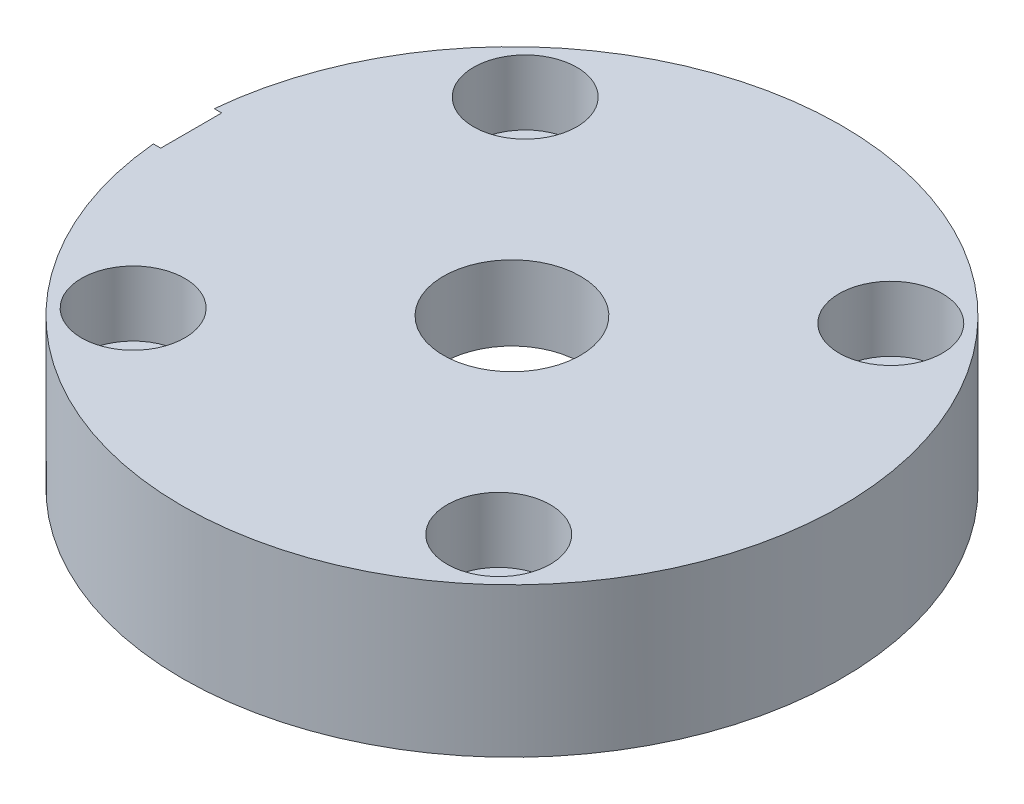
ISO-10303-21;
HEADER;
FILE_DESCRIPTION(('STEP AP214'),'2;1');
FILE_NAME('part.step','',(''),(''),'','','');
FILE_SCHEMA(('AUTOMOTIVE_DESIGN { 1 0 10303 214 1 1 1 1 }'));
ENDSEC;
DATA;
#1=APPLICATION_CONTEXT('core data for automotive mechanical design processes');
#2=APPLICATION_PROTOCOL_DEFINITION('international standard','automotive_design',2000,#1);
#3=PRODUCT_CONTEXT('',#1,'mechanical');
#4=PRODUCT('Part','Part','',(#3));
#5=PRODUCT_RELATED_PRODUCT_CATEGORY('part','',(#4));
#6=PRODUCT_DEFINITION_FORMATION('','',#4);
#7=PRODUCT_DEFINITION_CONTEXT('part definition',#1,'design');
#8=PRODUCT_DEFINITION('design','',#6,#7);
#9=PRODUCT_DEFINITION_SHAPE('','',#8);
#10=(LENGTH_UNIT() NAMED_UNIT(*) SI_UNIT(.MILLI.,.METRE.));
#11=(NAMED_UNIT(*) PLANE_ANGLE_UNIT() SI_UNIT($,.RADIAN.));
#12=(NAMED_UNIT(*) SI_UNIT($,.STERADIAN.) SOLID_ANGLE_UNIT());
#13=UNCERTAINTY_MEASURE_WITH_UNIT(LENGTH_MEASURE(1.E-05),#10,'distance_accuracy_value','');
#14=(GEOMETRIC_REPRESENTATION_CONTEXT(3) GLOBAL_UNCERTAINTY_ASSIGNED_CONTEXT((#13)) GLOBAL_UNIT_ASSIGNED_CONTEXT((#10,
#11,#12)) REPRESENTATION_CONTEXT('',''));
#15=CARTESIAN_POINT('',(0.,0.,0.));
#16=DIRECTION('',(0.,0.,1.));
#17=DIRECTION('',(1.,0.,0.));
#18=AXIS2_PLACEMENT_3D('',#15,#16,#17);
#19=CARTESIAN_POINT('',(19.05,0.,0.));
#20=DIRECTION('',(0.,1.,0.));
#21=DIRECTION('',(0.,0.,1.));
#22=AXIS2_PLACEMENT_3D('',#19,#20,#21);
#23=PLANE('',#22);
#24=CARTESIAN_POINT('',(-14.930490242014,0.,-4.1405913989565));
#25=DIRECTION('',(0.,-1.,0.));
#26=DIRECTION('',(0.,0.,-1.));
#27=AXIS2_PLACEMENT_3D('',#24,#25,#26);
#28=CIRCLE('',#27,1.72720000000001);
#29=CARTESIAN_POINT('',(-14.930490242014,0.,-5.86779139895651));
#30=VERTEX_POINT('',#29);
#31=EDGE_CURVE('E204',#30,#30,#28,.T.);
#32=ORIENTED_EDGE('',*,*,#31,.F.);
#33=EDGE_LOOP('',(#32));
#34=FACE_BOUND('',#33,.T.);
#35=CARTESIAN_POINT('',(4.1405913989565,0.,-14.930490242014));
#36=DIRECTION('',(0.,-1.,0.));
#37=DIRECTION('',(0.,0.,-1.));
#38=AXIS2_PLACEMENT_3D('',#35,#36,#37);
#39=CIRCLE('',#38,1.72720000000001);
#40=CARTESIAN_POINT('',(4.1405913989565,0.,-16.657690242014));
#41=VERTEX_POINT('',#40);
#42=EDGE_CURVE('E208',#41,#41,#39,.T.);
#43=ORIENTED_EDGE('',*,*,#42,.F.);
#44=EDGE_LOOP('',(#43));
#45=FACE_BOUND('',#44,.T.);
#46=CARTESIAN_POINT('',(14.930490242014,0.,4.1405913989565));
#47=DIRECTION('',(0.,-1.,0.));
#48=DIRECTION('',(0.,0.,-1.));
#49=AXIS2_PLACEMENT_3D('',#46,#47,#48);
#50=CIRCLE('',#49,1.72720000000002);
#51=CARTESIAN_POINT('',(14.930490242014,0.,2.41339139895649));
#52=VERTEX_POINT('',#51);
#53=EDGE_CURVE('E212',#52,#52,#50,.T.);
#54=ORIENTED_EDGE('',*,*,#53,.F.);
#55=EDGE_LOOP('',(#54));
#56=FACE_BOUND('',#55,.T.);
#57=CARTESIAN_POINT('',(-4.1405913989565,0.,14.930490242014));
#58=DIRECTION('',(0.,-1.,0.));
#59=DIRECTION('',(0.,0.,-1.));
#60=AXIS2_PLACEMENT_3D('',#57,#58,#59);
#61=CIRCLE('',#60,1.72720000000001);
#62=CARTESIAN_POINT('',(-4.1405913989565,0.,13.203290242014));
#63=VERTEX_POINT('',#62);
#64=EDGE_CURVE('E216',#63,#63,#61,.T.);
#65=ORIENTED_EDGE('',*,*,#64,.F.);
#66=EDGE_LOOP('',(#65));
#67=FACE_BOUND('',#66,.T.);
#68=CARTESIAN_POINT('',(0.,0.,0.));
#69=DIRECTION('',(0.,1.,0.));
#70=DIRECTION('',(0.,0.,1.));
#71=AXIS2_PLACEMENT_3D('',#68,#69,#70);
#72=CIRCLE('',#71,19.05);
#73=CARTESIAN_POINT('',(0.,0.,19.05));
#74=VERTEX_POINT('',#73);
#75=EDGE_CURVE('E172',#74,#74,#72,.T.);
#76=ORIENTED_EDGE('',*,*,#75,.F.);
#77=EDGE_LOOP('',(#76));
#78=FACE_BOUND('',#77,.T.);
#79=CARTESIAN_POINT('',(-10.566882590808,0.,-11.331594252887));
#80=DIRECTION('',(0.,1.,0.));
#81=DIRECTION('',(0.,0.,1.));
#82=AXIS2_PLACEMENT_3D('',#79,#80,#81);
#83=CIRCLE('',#82,1.98120000000001);
#84=CARTESIAN_POINT('',(-10.566882590808,0.,-9.35039425288699));
#85=VERTEX_POINT('',#84);
#86=EDGE_CURVE('E155',#85,#85,#83,.T.);
#87=ORIENTED_EDGE('',*,*,#86,.T.);
#88=EDGE_LOOP('',(#87));
#89=FACE_BOUND('',#88,.T.);
#90=CARTESIAN_POINT('',(-11.331594252887,0.,10.566882590808));
#91=DIRECTION('',(0.,1.,0.));
#92=DIRECTION('',(0.,0.,1.));
#93=AXIS2_PLACEMENT_3D('',#90,#91,#92);
#94=CIRCLE('',#93,1.98120000000001);
#95=CARTESIAN_POINT('',(-11.331594252887,0.,12.548082590808));
#96=VERTEX_POINT('',#95);
#97=EDGE_CURVE('E143',#96,#96,#94,.T.);
#98=ORIENTED_EDGE('',*,*,#97,.T.);
#99=EDGE_LOOP('',(#98));
#100=FACE_BOUND('',#99,.T.);
#101=CARTESIAN_POINT('',(10.566882590808,0.,11.331594252887));
#102=DIRECTION('',(0.,1.,0.));
#103=DIRECTION('',(0.,0.,1.));
#104=AXIS2_PLACEMENT_3D('',#101,#102,#103);
#105=CIRCLE('',#104,1.98120000000001);
#106=CARTESIAN_POINT('',(10.566882590808,0.,13.312794252887));
#107=VERTEX_POINT('',#106);
#108=EDGE_CURVE('E131',#107,#107,#105,.T.);
#109=ORIENTED_EDGE('',*,*,#108,.T.);
#110=EDGE_LOOP('',(#109));
#111=FACE_BOUND('',#110,.T.);
#112=CARTESIAN_POINT('',(11.331594252887,0.,-10.566882590808));
#113=DIRECTION('',(0.,1.,0.));
#114=DIRECTION('',(0.,0.,1.));
#115=AXIS2_PLACEMENT_3D('',#112,#113,#114);
#116=CIRCLE('',#115,1.98120000000001);
#117=CARTESIAN_POINT('',(11.331594252887,0.,-8.58568259080799));
#118=VERTEX_POINT('',#117);
#119=EDGE_CURVE('E119',#118,#118,#116,.T.);
#120=ORIENTED_EDGE('',*,*,#119,.T.);
#121=EDGE_LOOP('',(#120));
#122=FACE_BOUND('',#121,.T.);
#123=CARTESIAN_POINT('',(0.,0.,0.));
#124=DIRECTION('',(0.,1.,0.));
#125=DIRECTION('',(0.,0.,1.));
#126=AXIS2_PLACEMENT_3D('',#123,#124,#125);
#127=CIRCLE('',#126,10.3124);
#128=CARTESIAN_POINT('',(0.,0.,10.3124));
#129=VERTEX_POINT('',#128);
#130=EDGE_CURVE('E100',#129,#129,#127,.T.);
#131=ORIENTED_EDGE('',*,*,#130,.T.);
#132=EDGE_LOOP('',(#131));
#133=FACE_BOUND('',#132,.T.);
#134=ADVANCED_FACE('F38',(#34,#45,#56,#67,#78,#89,#100,#111,#122,#133),#23,.F.);
#135=CARTESIAN_POINT('',(-6.7286871769978,5.08,0.));
#136=DIRECTION('',(-1.,0.,0.));
#137=DIRECTION('',(0.,0.,1.));
#138=AXIS2_PLACEMENT_3D('',#135,#136,#137);
#139=CYLINDRICAL_SURFACE('',#138,1.98374);
#140=CARTESIAN_POINT('',(-18.11274,5.08,0.));
#141=DIRECTION('',(-1.,0.,0.));
#142=DIRECTION('',(0.,0.,1.));
#143=AXIS2_PLACEMENT_3D('',#140,#141,#142);
#144=CIRCLE('',#143,1.98374);
#145=CARTESIAN_POINT('',(-18.11274,5.08,1.98374));
#146=VERTEX_POINT('',#145);
#147=EDGE_CURVE('E159',#146,#146,#144,.T.);
#148=ORIENTED_EDGE('',*,*,#147,.T.);
#149=EDGE_LOOP('',(#148));
#150=FACE_BOUND('',#149,.T.);
#151=CARTESIAN_POINT('',(-7.874,5.08,0.));
#152=DIRECTION('',(-1.,0.,0.));
#153=DIRECTION('',(0.,0.,1.));
#154=AXIS2_PLACEMENT_3D('',#151,#152,#153);
#155=CIRCLE('',#154,1.98374);
#156=CARTESIAN_POINT('',(-7.874,4.318,1.831551360896));
#157=VERTEX_POINT('',#156);
#158=CARTESIAN_POINT('',(-7.874,4.318,-1.831551360896));
#159=VERTEX_POINT('',#158);
#160=EDGE_CURVE('E103',#157,#159,#155,.T.);
#161=ORIENTED_EDGE('',*,*,#160,.F.);
#162=DIRECTION('',(-1.,0.,0.));
#163=VECTOR('',#162,1.);
#164=CARTESIAN_POINT('',(-6.7286871769978,4.318,1.831551360896));
#165=LINE('',#164,#163);
#166=CARTESIAN_POINT('',(-10.1484488160704,4.318,1.831551360896));
#167=VERTEX_POINT('',#166);
#168=EDGE_CURVE('E58',#157,#167,#165,.T.);
#169=ORIENTED_EDGE('',*,*,#168,.T.);
#170=CARTESIAN_POINT('',(-10.1484488160704,4.318,1.831551360896));
#171=CARTESIAN_POINT('',(-10.1523307295266,4.26627741997668,1.81003212563262));
#172=CARTESIAN_POINT('',(-10.15653749903,4.21551387213309,1.78634128802486));
#173=CARTESIAN_POINT('',(-10.1654720150666,4.11621010978478,1.73478131015529));
#174=CARTESIAN_POINT('',(-10.1701997016872,4.06766964050244,1.70691265026827));
#175=CARTESIAN_POINT('',(-10.1849570570044,3.92597187191447,1.61737304930524));
#176=CARTESIAN_POINT('',(-10.1955740427077,3.83657361776582,1.54969974576053));
#177=CARTESIAN_POINT('',(-10.2171581892262,3.67047336798419,1.4003405696009));
#178=CARTESIAN_POINT('',(-10.2281254202561,3.59377393742458,1.31865187274376));
#179=CARTESIAN_POINT('',(-10.2491864676427,3.45514512602281,1.14347585732607));
#180=CARTESIAN_POINT('',(-10.2592804042456,3.39321370966328,1.04999016749801));
#181=CARTESIAN_POINT('',(-10.2774852960261,3.28579964890034,0.853593190312652));
#182=CARTESIAN_POINT('',(-10.2855925327254,3.24034777394583,0.750664716279641));
#183=CARTESIAN_POINT('',(-10.2988824125913,3.16743537675203,0.538430418401741));
#184=CARTESIAN_POINT('',(-10.3040650614484,3.13997481950688,0.429124606965739));
#185=CARTESIAN_POINT('',(-10.3108620074707,3.10419314226036,0.208966054624748));
#186=CARTESIAN_POINT('',(-10.3125275777648,3.09559693772033,0.0981595874973822));
#187=CARTESIAN_POINT('',(-10.3122570681653,3.09700288063558,-0.123326019492647));
#188=CARTESIAN_POINT('',(-10.3103212299676,3.10700378001201,-0.23400516740109));
#189=CARTESIAN_POINT('',(-10.303102825486,3.14508450537033,-0.450921697192626));
#190=CARTESIAN_POINT('',(-10.2978545354903,3.17297921917175,-0.5571928301728));
#191=CARTESIAN_POINT('',(-10.2846156137339,3.24581777185274,-0.763525760558363));
#192=CARTESIAN_POINT('',(-10.2766250787238,3.29076100924008,-0.863587776883885));
#193=CARTESIAN_POINT('',(-10.258674292042,3.39691372158333,-1.05574956711831));
#194=CARTESIAN_POINT('',(-10.2486958336015,3.45827549792353,-1.14776349728511));
#195=CARTESIAN_POINT('',(-10.2279021946964,3.59534570125691,-1.32029409940203));
#196=CARTESIAN_POINT('',(-10.2170868413331,3.67105709752548,-1.40080838574683));
#197=CARTESIAN_POINT('',(-10.1956355812196,3.83606527298908,-1.54930006696661));
#198=CARTESIAN_POINT('',(-10.185004621706,3.92554476283416,-1.61707660247916));
#199=CARTESIAN_POINT('',(-10.170227729714,4.06738572977835,-1.70674650905111));
#200=CARTESIAN_POINT('',(-10.1654936100975,4.11597948240959,-1.73465534615503));
#201=CARTESIAN_POINT('',(-10.156547364646,4.21539483525796,-1.78628567346737));
#202=CARTESIAN_POINT('',(-10.1523352921309,4.266216662326,-1.81000673605668));
#203=CARTESIAN_POINT('',(-10.1484488160704,4.318,-1.831551360896));
#204=B_SPLINE_CURVE_WITH_KNOTS('',3,(#170,#171,#172,#173,#174,#175,#176,#177,#178,#179,#180,
#181,#182,#183,#184,#185,#186,#187,#188,#189,#190,#191,#192,#193,#194,#195,#196,#197,#198,#199,
#200,#201,#202,#203),.UNSPECIFIED.,.F.,.F.,(4,2,2,2,2,2,2,2,2,2,2,2,2,2,2,2,4),(0.,
0.168357652079969,0.33669596087014,0.672842913717333,1.00905768327299,1.34522608457076,
1.68201896246432,2.01881118505528,2.35065864720445,2.6824838393889,3.01093046505153,
3.33936550380318,3.67095964884576,4.00262248361132,4.33914225790786,4.50767980160797,
4.67623454495431),.UNSPECIFIED.);
#205=CARTESIAN_POINT('',(-10.1484488160704,4.318,-1.831551360896));
#206=VERTEX_POINT('',#205);
#207=EDGE_CURVE('E11',#167,#206,#204,.T.);
#208=ORIENTED_EDGE('',*,*,#207,.T.);
#209=DIRECTION('',(-1.,0.,0.));
#210=VECTOR('',#209,1.);
#211=CARTESIAN_POINT('',(-6.7286871769978,4.318,-1.831551360896));
#212=LINE('',#211,#210);
#213=EDGE_CURVE('E86',#206,#159,#212,.F.);
#214=ORIENTED_EDGE('',*,*,#213,.T.);
#215=EDGE_LOOP('',(#161,#169,#208,#214));
#216=FACE_BOUND('',#215,.T.);
#217=ADVANCED_FACE('F102',(#150,#216),#139,.F.);
#218=CARTESIAN_POINT('',(-6.7286871769978,5.08,0.));
#219=DIRECTION('',(-1.,0.,0.));
#220=DIRECTION('',(0.,0.,1.));
#221=AXIS2_PLACEMENT_3D('',#218,#219,#220);
#222=CONICAL_SURFACE('',#221,0.,1.04719755119661);
#223=CARTESIAN_POINT('',(-6.7286871769978,5.08,0.));
#224=VERTEX_POINT('',#223);
#225=VERTEX_LOOP('',#224);
#226=FACE_BOUND('',#225,.T.);
#227=ORIENTED_EDGE('',*,*,#160,.T.);
#228=CARTESIAN_POINT('',(-12.6421139007186,4.318,-10.213970963854));
#229=CARTESIAN_POINT('',(-12.4351985762305,4.318,-9.85457870393848));
#230=CARTESIAN_POINT('',(-12.2283217443316,4.318,-9.49516426201814));
#231=CARTESIAN_POINT('',(-11.8146913046481,4.318,-8.77625231538468));
#232=CARTESIAN_POINT('',(-11.6079377001314,4.318,-8.41675480879139));
#233=CARTESIAN_POINT('',(-11.1944703469547,4.318,-7.69741250361713));
#234=CARTESIAN_POINT('',(-10.9877567203897,4.318,-7.33756763484118));
#235=CARTESIAN_POINT('',(-10.5746126076001,4.318,-6.61772722359468));
#236=CARTESIAN_POINT('',(-10.3681821144916,4.318,-6.2577316850755));
#237=CARTESIAN_POINT('',(-9.95968768248124,4.318,-5.54432516436905));
#238=CARTESIAN_POINT('',(-9.7576152953929,4.318,-5.19091902366825));
#239=CARTESIAN_POINT('',(-9.45508854476997,4.318,-4.66046012056802));
#240=CARTESIAN_POINT('',(-9.35433945859025,4.318,-4.48357549314924));
#241=CARTESIAN_POINT('',(-9.15312349013212,4.318,-4.12964739051578));
#242=CARTESIAN_POINT('',(-9.05265660588798,4.318,-3.95260391641896));
#243=CARTESIAN_POINT('',(-8.85217689368765,4.318,-3.59836307780747));
#244=CARTESIAN_POINT('',(-8.7521638847271,4.318,-3.42116581584852));
#245=CARTESIAN_POINT('',(-8.5527722333675,4.318,-3.06640835218996));
#246=CARTESIAN_POINT('',(-8.45339360819812,4.318,-2.8888481408042));
#247=CARTESIAN_POINT('',(-8.25569086620411,4.318,-2.53316994336678));
#248=CARTESIAN_POINT('',(-8.1573666103218,4.318,-2.35505203497316));
#249=CARTESIAN_POINT('',(-8.01135221073934,4.318,-2.0870773161165));
#250=CARTESIAN_POINT('',(-7.96292711572625,4.318,-1.99762139485185));
#251=CARTESIAN_POINT('',(-7.86679067570531,4.318,-1.81832726244077));
#252=CARTESIAN_POINT('',(-7.81907931934931,4.318,-1.72848905740173));
#253=CARTESIAN_POINT('',(-7.75164591941841,4.318,-1.5996726107599));
#254=CARTESIAN_POINT('',(-7.73148704362812,4.318,-1.56092319454405));
#255=CARTESIAN_POINT('',(-7.69141219775997,4.318,-1.48329891447636));
#256=CARTESIAN_POINT('',(-7.67149622876682,4.318,-1.44442405006531));
#257=CARTESIAN_POINT('',(-7.61217846805923,4.318,-1.32756086398001));
#258=CARTESIAN_POINT('',(-7.5732143840617,4.318,-1.24934830841128));
#259=CARTESIAN_POINT('',(-7.49676835109029,4.318,-1.09136559578504));
#260=CARTESIAN_POINT('',(-7.45930208277983,4.318,-1.01158782282272));
#261=CARTESIAN_POINT('',(-7.38738900371223,4.318,-0.850676102364785));
#262=CARTESIAN_POINT('',(-7.35294123694426,4.318,-0.76954259401793));
#263=CARTESIAN_POINT('',(-7.30317665827933,4.318,-0.640816563498244));
#264=CARTESIAN_POINT('',(-7.28604113454907,4.318,-0.593934432476262));
#265=CARTESIAN_POINT('',(-7.25419840967685,4.318,-0.499324486855882));
#266=CARTESIAN_POINT('',(-7.23949180795117,4.318,-0.451596466714827));
#267=CARTESIAN_POINT('',(-7.21364476751895,4.318,-0.355900729456643));
#268=CARTESIAN_POINT('',(-7.20245583275983,4.318,-0.307946460135937));
#269=CARTESIAN_POINT('',(-7.18445827247465,4.318,-0.211241815614578));
#270=CARTESIAN_POINT('',(-7.17764522572811,4.318,-0.162492295145517));
#271=CARTESIAN_POINT('',(-7.16923706949777,4.318,-0.0635555869989476));
#272=CARTESIAN_POINT('',(-7.16774716946068,4.318,-0.0133589764876991));
#273=CARTESIAN_POINT('',(-7.17053193272296,4.318,0.0868676607141219));
#274=CARTESIAN_POINT('',(-7.17480689626077,4.318,0.136897678592384));
#275=CARTESIAN_POINT('',(-7.1885335914927,4.318,0.236932066628424));
#276=CARTESIAN_POINT('',(-7.19805782767699,4.318,0.28692602558697));
#277=CARTESIAN_POINT('',(-7.22114911055427,4.318,0.385970530157997));
#278=CARTESIAN_POINT('',(-7.23471860328534,4.318,0.435020485803888));
#279=CARTESIAN_POINT('',(-7.26220680227894,4.318,0.523870930408157));
#280=CARTESIAN_POINT('',(-7.27566758464519,4.318,0.563816660237937));
#281=CARTESIAN_POINT('',(-7.30411224466066,4.318,0.643165589828912));
#282=CARTESIAN_POINT('',(-7.319096393719,4.318,0.682568691488382));
#283=CARTESIAN_POINT('',(-7.36577415959805,4.318,0.800167302979329));
#284=CARTESIAN_POINT('',(-7.39917003182975,4.318,0.877682534195167));
#285=CARTESIAN_POINT('',(-7.46866871424788,4.318,1.0316768573247));
#286=CARTESIAN_POINT('',(-7.50477760774376,4.318,1.1081531374912));
#287=CARTESIAN_POINT('',(-7.57865356032206,4.318,1.26030760505142));
#288=CARTESIAN_POINT('',(-7.61642079782666,4.318,1.33598570547684));
#289=CARTESIAN_POINT('',(-7.69330093674509,4.318,1.48730960930965));
#290=CARTESIAN_POINT('',(-7.73242132665139,4.318,1.56295158486141));
#291=CARTESIAN_POINT('',(-7.81141799334022,4.318,1.71385053953798));
#292=CARTESIAN_POINT('',(-7.85129436072969,4.318,1.78910747112344));
#293=CARTESIAN_POINT('',(-7.93150640383571,4.318,1.9391961619211));
#294=CARTESIAN_POINT('',(-7.9718410903282,4.318,2.01402845086505));
#295=CARTESIAN_POINT('',(-8.05290081774712,4.318,2.16347708157936));
#296=CARTESIAN_POINT('',(-8.09362584258059,4.318,2.23809343208876));
#297=CARTESIAN_POINT('',(-8.21566811559389,4.318,2.46066290011918));
#298=CARTESIAN_POINT('',(-8.2974145363997,4.318,2.60838053669606));
#299=CARTESIAN_POINT('',(-8.46160593736872,4.318,2.90342727021812));
#300=CARTESIAN_POINT('',(-8.54405092211105,4.318,3.05075636460809));
#301=CARTESIAN_POINT('',(-8.79206408310925,4.318,3.49237483842666));
#302=CARTESIAN_POINT('',(-8.95830526108326,4.318,3.78628600645931));
#303=CARTESIAN_POINT('',(-9.2917988261787,4.318,4.3738732252103));
#304=CARTESIAN_POINT('',(-9.4590519717734,4.318,4.66754884419257));
#305=CARTESIAN_POINT('',(-9.79406105253119,4.318,5.25460738334325));
#306=CARTESIAN_POINT('',(-9.96181698015205,4.318,5.54799030781524));
#307=CARTESIAN_POINT('',(-10.2901353069629,4.318,6.12146967356501));
#308=CARTESIAN_POINT('',(-10.4506841167621,4.318,6.40157390027895));
#309=CARTESIAN_POINT('',(-10.7719751602492,4.318,6.96167322782823));
#310=CARTESIAN_POINT('',(-10.9327173948855,4.318,7.24166832811956));
#311=CARTESIAN_POINT('',(-11.2541887183236,4.318,7.80132333583191));
#312=CARTESIAN_POINT('',(-11.4149176830248,4.318,8.0809833145517));
#313=CARTESIAN_POINT('',(-11.736475660895,4.318,8.64024380941629));
#314=CARTESIAN_POINT('',(-11.8973046735379,4.318,8.91984432586358));
#315=CARTESIAN_POINT('',(-12.0581672569026,4.318,9.19942551284108));
#316=B_SPLINE_CURVE_WITH_KNOTS('',3,(#228,#229,#230,#231,#232,#233,#234,#235,#236,#237,#238,
#239,#240,#241,#242,#243,#244,#245,#246,#247,#248,#249,#250,#251,#252,#253,#254,#255,#256,#257,
#258,#259,#260,#261,#262,#263,#264,#265,#266,#267,#268,#269,#270,#271,#272,#273,#274,#275,#276,
#277,#278,#279,#280,#281,#282,#283,#284,#285,#286,#287,#288,#289,#290,#291,#292,#293,#294,#295,
#296,#297,#298,#299,#300,#301,#302,#303,#304,#305,#306,#307,#308,#309,#310,#311,#312,#313,#314,
#315),.UNSPECIFIED.,.F.,.F.,(4,2,2,2,2,2,2,2,2,2,2,2,2,2,2,2,2,2,2,2,2,2,2,2,2,2,2,2,2,2,2,2,2,
2,2,2,2,2,2,2,2,2,2,4),(0.,1.24410240310473,2.48823644978931,3.73321414117173,4.97816100628882,
6.19945569407865,6.8101493336783,7.42083870875262,8.03125826094575,8.64169432199573,
9.25204885897906,9.55721280746405,9.86237189879484,9.99340953968278,10.1244477655121,
10.386572898609,10.6509587011265,10.9152604631972,11.0649614390119,11.214699303436,
11.3622717503738,11.5096948605442,11.6600160793269,11.8103451272546,11.9628045771778,
12.115356402118,12.2417783999648,12.3682229612649,12.621331599279,12.8750257597623,
13.1287472825463,13.3842199484575,13.6397234298318,13.8947529558077,14.1497720122002,
14.6562530416899,15.1627373937604,16.175738337263,17.1896269841333,18.2035004970342,
19.1720605335987,20.1406253382923,21.108298575083,22.0759667653459),.UNSPECIFIED.);
#317=EDGE_CURVE('E91',#159,#157,#316,.T.);
#318=ORIENTED_EDGE('',*,*,#317,.T.);
#319=EDGE_LOOP('',(#227,#318));
#320=FACE_BOUND('',#319,.T.);
#321=ADVANCED_FACE('F199',(#226,#320),#222,.F.);
#322=CARTESIAN_POINT('',(0.,0.,0.));
#323=DIRECTION('',(0.,-1.,0.));
#324=DIRECTION('',(0.,0.,-1.));
#325=AXIS2_PLACEMENT_3D('',#322,#323,#324);
#326=CYLINDRICAL_SURFACE('',#325,3.96240000000001);
#327=CARTESIAN_POINT('',(0.,8.636,0.));
#328=DIRECTION('',(0.,-1.,0.));
#329=DIRECTION('',(0.,0.,-1.));
#330=AXIS2_PLACEMENT_3D('',#327,#328,#329);
#331=CIRCLE('',#330,3.96240000000001);
#332=CARTESIAN_POINT('',(0.,8.636,-3.96240000000001));
#333=VERTEX_POINT('',#332);
#334=EDGE_CURVE('E104',#333,#333,#331,.T.);
#335=ORIENTED_EDGE('',*,*,#334,.F.);
#336=EDGE_LOOP('',(#335));
#337=FACE_BOUND('',#336,.T.);
#338=CARTESIAN_POINT('',(0.,4.318,0.));
#339=DIRECTION('',(0.,-1.,0.));
#340=DIRECTION('',(0.,0.,-1.));
#341=AXIS2_PLACEMENT_3D('',#338,#339,#340);
#342=CIRCLE('',#341,3.96240000000001);
#343=CARTESIAN_POINT('',(0.,4.318,-3.96240000000001));
#344=VERTEX_POINT('',#343);
#345=EDGE_CURVE('E99',#344,#344,#342,.F.);
#346=ORIENTED_EDGE('',*,*,#345,.F.);
#347=EDGE_LOOP('',(#346));
#348=FACE_BOUND('',#347,.T.);
#349=ADVANCED_FACE('F247',(#337,#348),#326,.F.);
#350=CARTESIAN_POINT('',(0.,8.636,0.));
#351=DIRECTION('',(0.,-1.,0.));
#352=DIRECTION('',(0.,0.,-1.));
#353=AXIS2_PLACEMENT_3D('',#350,#351,#352);
#354=PLANE('',#353);
#355=ORIENTED_EDGE('',*,*,#334,.T.);
#356=EDGE_LOOP('',(#355));
#357=FACE_BOUND('',#356,.T.);
#358=CARTESIAN_POINT('',(11.331594252887,8.636,-10.566882590808));
#359=DIRECTION('',(0.,1.,0.));
#360=DIRECTION('',(0.,0.,1.));
#361=AXIS2_PLACEMENT_3D('',#358,#359,#360);
#362=CIRCLE('',#361,2.98450000000001);
#363=CARTESIAN_POINT('',(11.331594252887,8.636,-7.58238259080798));
#364=VERTEX_POINT('',#363);
#365=EDGE_CURVE('E107',#364,#364,#362,.T.);
#366=ORIENTED_EDGE('',*,*,#365,.F.);
#367=EDGE_LOOP('',(#366));
#368=FACE_BOUND('',#367,.T.);
#369=CARTESIAN_POINT('',(10.566882590808,8.636,11.331594252887));
#370=DIRECTION('',(0.,1.,0.));
#371=DIRECTION('',(0.,0.,1.));
#372=AXIS2_PLACEMENT_3D('',#369,#370,#371);
#373=CIRCLE('',#372,2.98450000000001);
#374=CARTESIAN_POINT('',(10.566882590808,8.636,14.316094252887));
#375=VERTEX_POINT('',#374);
#376=EDGE_CURVE('E122',#375,#375,#373,.T.);
#377=ORIENTED_EDGE('',*,*,#376,.F.);
#378=EDGE_LOOP('',(#377));
#379=FACE_BOUND('',#378,.T.);
#380=CARTESIAN_POINT('',(-11.331594252887,8.636,10.566882590808));
#381=DIRECTION('',(0.,1.,0.));
#382=DIRECTION('',(0.,0.,1.));
#383=AXIS2_PLACEMENT_3D('',#380,#381,#382);
#384=CIRCLE('',#383,2.98450000000001);
#385=CARTESIAN_POINT('',(-11.331594252887,8.636,13.551382590808));
#386=VERTEX_POINT('',#385);
#387=EDGE_CURVE('E134',#386,#386,#384,.T.);
#388=ORIENTED_EDGE('',*,*,#387,.F.);
#389=EDGE_LOOP('',(#388));
#390=FACE_BOUND('',#389,.T.);
#391=CARTESIAN_POINT('',(-10.566882590808,8.636,-11.331594252887));
#392=DIRECTION('',(0.,1.,0.));
#393=DIRECTION('',(0.,0.,1.));
#394=AXIS2_PLACEMENT_3D('',#391,#392,#393);
#395=CIRCLE('',#394,2.98450000000001);
#396=CARTESIAN_POINT('',(-10.566882590808,8.636,-8.34709425288698));
#397=VERTEX_POINT('',#396);
#398=EDGE_CURVE('E146',#397,#397,#395,.T.);
#399=ORIENTED_EDGE('',*,*,#398,.F.);
#400=EDGE_LOOP('',(#399));
#401=FACE_BOUND('',#400,.T.);
#402=DIRECTION('',(-1.,0.,0.));
#403=VECTOR('',#402,1.);
#404=CARTESIAN_POINT('',(-6.7286871769978,8.636,1.76233951397));
#405=LINE('',#404,#403);
#406=CARTESIAN_POINT('',(-18.968306709812,8.636,1.76233951397));
#407=VERTEX_POINT('',#406);
#408=CARTESIAN_POINT('',(-18.542,8.636,1.76233951397));
#409=VERTEX_POINT('',#408);
#410=EDGE_CURVE('E170',#407,#409,#405,.F.);
#411=ORIENTED_EDGE('',*,*,#410,.F.);
#412=CARTESIAN_POINT('',(0.,8.636,0.));
#413=DIRECTION('',(0.,1.,0.));
#414=DIRECTION('',(0.,0.,1.));
#415=AXIS2_PLACEMENT_3D('',#412,#413,#414);
#416=CIRCLE('',#415,19.05);
#417=CARTESIAN_POINT('',(-18.968306709812,8.636,-1.76233951397));
#418=VERTEX_POINT('',#417);
#419=EDGE_CURVE('E175',#407,#418,#416,.T.);
#420=ORIENTED_EDGE('',*,*,#419,.T.);
#421=DIRECTION('',(-1.,0.,0.));
#422=VECTOR('',#421,1.);
#423=CARTESIAN_POINT('',(-6.7286871769978,8.636,-1.76233951397));
#424=LINE('',#423,#422);
#425=CARTESIAN_POINT('',(-18.542,8.636,-1.76233951397));
#426=VERTEX_POINT('',#425);
#427=EDGE_CURVE('E168',#426,#418,#424,.T.);
#428=ORIENTED_EDGE('',*,*,#427,.F.);
#429=DIRECTION('',(0.,0.,-1.));
#430=VECTOR('',#429,1.);
#431=CARTESIAN_POINT('',(-18.542,8.636,0.));
#432=LINE('',#431,#430);
#433=EDGE_CURVE('E51',#409,#426,#432,.T.);
#434=ORIENTED_EDGE('',*,*,#433,.F.);
#435=EDGE_LOOP('',(#411,#420,#428,#434));
#436=FACE_BOUND('',#435,.T.);
#437=ADVANCED_FACE('F40',(#357,#368,#379,#390,#401,#436),#354,.F.);
#438=CARTESIAN_POINT('',(0.,0.,0.));
#439=DIRECTION('',(0.,1.,0.));
#440=DIRECTION('',(0.,0.,1.));
#441=AXIS2_PLACEMENT_3D('',#438,#439,#440);
#442=CYLINDRICAL_SURFACE('',#441,19.05);
#443=ORIENTED_EDGE('',*,*,#75,.T.);
#444=EDGE_LOOP('',(#443));
#445=FACE_BOUND('',#444,.T.);
#446=CARTESIAN_POINT('',(-18.968306709812,8.636,-1.76233951397));
#447=CARTESIAN_POINT('',(-18.958973143008,8.58619641595596,-1.86285332701888));
#448=CARTESIAN_POINT('',(-18.9490255242818,8.53214126342431,-1.96119268943215));
#449=CARTESIAN_POINT('',(-18.9282036775732,8.41596585477278,-2.15286953737453));
#450=CARTESIAN_POINT('',(-18.9173295472481,8.3538464482893,-2.24620754837621));
#451=CARTESIAN_POINT('',(-18.8949595211944,8.22200196483473,-2.4272061282805));
#452=CARTESIAN_POINT('',(-18.8834639304195,8.15228060140373,-2.51486943620446));
#453=CARTESIAN_POINT('',(-18.8601743041453,8.00573018806637,-2.68395474043862));
#454=CARTESIAN_POINT('',(-18.8483802664707,7.92890108633972,-2.76537669123713));
#455=CARTESIAN_POINT('',(-18.8130415561964,7.68846180985587,-2.99947333836041));
#456=CARTESIAN_POINT('',(-18.7895254061489,7.51481561237189,-3.14209397921449));
#457=CARTESIAN_POINT('',(-18.7452876715468,7.14586200820587,-3.39608674481463));
#458=CARTESIAN_POINT('',(-18.7245654930498,6.95055922141972,-3.50746551641281));
#459=CARTESIAN_POINT('',(-18.6883165743046,6.54375495856327,-3.6957459443969));
#460=CARTESIAN_POINT('',(-18.6727839928002,6.33227202628185,-3.77268639690454));
#461=CARTESIAN_POINT('',(-18.64873941695,5.89896331077316,-3.88981257071471));
#462=CARTESIAN_POINT('',(-18.640227320372,5.6771376782058,-3.92999882723204));
#463=CARTESIAN_POINT('',(-18.6313484869153,5.23405341146186,-3.97187670625916));
#464=CARTESIAN_POINT('',(-18.630827607966,5.01286657184159,-3.97429681334053));
#465=CARTESIAN_POINT('',(-18.6375957868141,4.57329670753198,-3.94243342513674));
#466=CARTESIAN_POINT('',(-18.6448840815895,4.35491341102258,-3.9081535157523));
#467=CARTESIAN_POINT('',(-18.6663197260181,3.92896342125705,-3.80443821890758));
#468=CARTESIAN_POINT('',(-18.6804097045272,3.72132205758918,-3.73529667073165));
#469=CARTESIAN_POINT('',(-18.7138264053601,3.32053739830261,-3.56409411206283));
#470=CARTESIAN_POINT('',(-18.733153726959,3.12739576502529,-3.46202933412462));
#471=CARTESIAN_POINT('',(-18.7752479826415,2.75778087062878,-3.22600499179433));
#472=CARTESIAN_POINT('',(-18.7980642002181,2.58161727621635,-3.09156937565959));
#473=CARTESIAN_POINT('',(-18.8443863772706,2.25409951155382,-2.79535805108399));
#474=CARTESIAN_POINT('',(-18.8678924048525,2.10274780080019,-2.63357963549202));
#475=CARTESIAN_POINT('',(-18.913379767912,1.82680767384406,-2.2842937266163));
#476=CARTESIAN_POINT('',(-18.9353322468822,1.70266453239125,-2.09643020667183));
#477=CARTESIAN_POINT('',(-18.9748428716231,1.48773836687204,-1.7020724594519));
#478=CARTESIAN_POINT('',(-18.9924012780855,1.39695336358146,-1.49557933842436));
#479=CARTESIAN_POINT('',(-19.0210138401898,1.25214555516241,-1.07157371465098));
#480=CARTESIAN_POINT('',(-19.0321210406746,1.1978223505717,-0.854167524451744));
#481=CARTESIAN_POINT('',(-19.0467981758083,1.12649038306393,-0.413078038693404));
#482=CARTESIAN_POINT('',(-19.0503690791397,1.10947682451792,-0.189395553607289));
#483=CARTESIAN_POINT('',(-19.0495772317718,1.11328085877481,0.253484204795391));
#484=CARTESIAN_POINT('',(-19.0453597540993,1.13340572109987,0.472688033727692));
#485=CARTESIAN_POINT('',(-19.0297412457593,1.2094834061704,0.904513423398371));
#486=CARTESIAN_POINT('',(-19.0183402156396,1.26543622618358,1.11713498463872));
#487=CARTESIAN_POINT('',(-18.9896018543378,1.41141158594472,1.52981412386955));
#488=CARTESIAN_POINT('',(-18.9722664470846,1.50142308484162,1.72987574895449));
#489=CARTESIAN_POINT('',(-18.9335185849823,1.71289875322803,2.11218894646345));
#490=CARTESIAN_POINT('',(-18.912105668448,1.83436648498182,2.29443849853567));
#491=CARTESIAN_POINT('',(-18.867069513541,2.10791786285438,2.63951874170536));
#492=CARTESIAN_POINT('',(-18.8434130803625,2.26051957816156,2.80193455206637));
#493=CARTESIAN_POINT('',(-18.7968362957805,2.59078196332187,3.09905069849851));
#494=CARTESIAN_POINT('',(-18.7739160022984,2.76844459913091,3.23374885816074));
#495=CARTESIAN_POINT('',(-18.7311738195718,3.14589046356831,3.47283296916353));
#496=CARTESIAN_POINT('',(-18.7113836082402,3.3458687287423,3.57691717489517));
#497=CARTESIAN_POINT('',(-18.6774913752077,3.76095608566634,3.74988482460711));
#498=CARTESIAN_POINT('',(-18.6633886160861,3.97606321159627,3.81877283234714));
#499=CARTESIAN_POINT('',(-18.642721210832,4.41200351153388,3.91842106231878));
#500=CARTESIAN_POINT('',(-18.6360503439418,4.63270862748064,3.9497190619254));
#501=CARTESIAN_POINT('',(-18.6306834804124,5.07634105591598,3.9749607463178));
#502=CARTESIAN_POINT('',(-18.6319870207985,5.29926823864658,3.96890659967758));
#503=CARTESIAN_POINT('',(-18.6423242175272,5.73719962728297,3.92005548210126));
#504=CARTESIAN_POINT('',(-18.6512326241226,5.9522736511782,3.87785381182771));
#505=CARTESIAN_POINT('',(-18.6755815307074,6.37220346109661,3.75883035614601));
#506=CARTESIAN_POINT('',(-18.6910216176735,6.5770598923021,3.68201075974282));
#507=CARTESIAN_POINT('',(-18.7268288487942,6.97254820054594,3.49534714819804));
#508=CARTESIAN_POINT('',(-18.747232847204,7.16305902726109,3.38525454475525));
#509=CARTESIAN_POINT('',(-18.7906601126224,7.52323240535834,3.13522029138339));
#510=CARTESIAN_POINT('',(-18.813684081736,7.69288934281656,2.9952706314703));
#511=CARTESIAN_POINT('',(-18.8485141610752,7.92978317919434,2.76446204775276));
#512=CARTESIAN_POINT('',(-18.860294644806,8.00650320524893,2.68310649950865));
#513=CARTESIAN_POINT('',(-18.8835569249808,8.15284989075131,2.51416862108585));
#514=CARTESIAN_POINT('',(-18.8950387179518,8.22247646774784,2.42658621854891));
#515=CARTESIAN_POINT('',(-18.9173832403401,8.35415509563139,2.24575212905131));
#516=CARTESIAN_POINT('',(-18.9282455913533,8.41620254246069,2.15249704714791));
#517=CARTESIAN_POINT('',(-18.9490451981353,8.53224822268096,1.96099811666389));
#518=CARTESIAN_POINT('',(-18.9589823730027,8.58624575240042,1.86275383296477));
#519=CARTESIAN_POINT('',(-18.968306709812,8.636,1.76233951396999));
#520=B_SPLINE_CURVE_WITH_KNOTS('',3,(#446,#447,#448,#449,#450,#451,#452,#453,#454,#455,#456,
#457,#458,#459,#460,#461,#462,#463,#464,#465,#466,#467,#468,#469,#470,#471,#472,#473,#474,#475,
#476,#477,#478,#479,#480,#481,#482,#483,#484,#485,#486,#487,#488,#489,#490,#491,#492,#493,#494,
#495,#496,#497,#498,#499,#500,#501,#502,#503,#504,#505,#506,#507,#508,#509,#510,#511,#512,#513,
#514,#515,#516,#517,#518,#519),.UNSPECIFIED.,.F.,.F.,(4,2,2,2,2,2,2,2,2,2,2,2,2,2,2,2,2,2,2,2,2,
2,2,2,2,2,2,2,2,2,2,2,2,2,2,2,4),(0.,0.337572816039461,0.675110094788698,1.01248321982203,
1.34985880473057,2.02418534569581,2.69836831156711,3.37178986038956,4.04520160268767,
4.70560725445807,5.36594838492269,6.02081446457129,6.67575550794353,7.3409896625001,
8.00628971906775,8.6817766310788,9.35722345823893,10.0270348103806,10.6967600626695,
11.3541192135724,12.0114783143439,12.6686245003811,13.3258451375725,13.9950546571899,
14.6643167035624,15.3399697793772,16.0155352235287,16.6813160341803,17.3470581915947,
18.0020427558191,18.6569859090326,19.31694857332,19.9770885140546,20.3140905703442,
20.6510965433565,20.9883062282828,21.3255453726298),.UNSPECIFIED.);
#521=EDGE_CURVE('E65',#418,#407,#520,.T.);
#522=ORIENTED_EDGE('',*,*,#521,.F.);
#523=ORIENTED_EDGE('',*,*,#419,.F.);
#524=EDGE_LOOP('',(#522,#523));
#525=FACE_BOUND('',#524,.T.);
#526=ADVANCED_FACE('F183',(#445,#525),#442,.T.);
#527=CARTESIAN_POINT('',(-18.542,9.04875,0.));
#528=DIRECTION('',(-1.,0.,0.));
#529=DIRECTION('',(0.,0.,1.));
#530=AXIS2_PLACEMENT_3D('',#527,#528,#529);
#531=PLANE('',#530);
#532=CARTESIAN_POINT('',(-18.542,5.08,0.));
#533=DIRECTION('',(-1.,0.,0.));
#534=DIRECTION('',(0.,0.,1.));
#535=AXIS2_PLACEMENT_3D('',#532,#533,#534);
#536=CIRCLE('',#535,2.413);
#537=CARTESIAN_POINT('',(-18.542,5.08,2.413));
#538=VERTEX_POINT('',#537);
#539=EDGE_CURVE('E162',#538,#538,#536,.T.);
#540=ORIENTED_EDGE('',*,*,#539,.F.);
#541=EDGE_LOOP('',(#540));
#542=FACE_BOUND('',#541,.T.);
#543=ORIENTED_EDGE('',*,*,#433,.T.);
#544=CARTESIAN_POINT('',(-18.542,5.08,0.));
#545=DIRECTION('',(-1.,0.,0.));
#546=DIRECTION('',(0.,0.,1.));
#547=AXIS2_PLACEMENT_3D('',#544,#545,#546);
#548=CIRCLE('',#547,3.96875);
#549=EDGE_CURVE('E165',#426,#409,#548,.T.);
#550=ORIENTED_EDGE('',*,*,#549,.T.);
#551=EDGE_LOOP('',(#543,#550));
#552=FACE_BOUND('',#551,.T.);
#553=ADVANCED_FACE('F191',(#542,#552),#531,.T.);
#554=CARTESIAN_POINT('',(-6.7286871769978,5.08,0.));
#555=DIRECTION('',(-1.,0.,0.));
#556=DIRECTION('',(0.,0.,1.));
#557=AXIS2_PLACEMENT_3D('',#554,#555,#556);
#558=CYLINDRICAL_SURFACE('',#557,3.96875);
#559=ORIENTED_EDGE('',*,*,#410,.T.);
#560=ORIENTED_EDGE('',*,*,#549,.F.);
#561=ORIENTED_EDGE('',*,*,#427,.T.);
#562=ORIENTED_EDGE('',*,*,#521,.T.);
#563=EDGE_LOOP('',(#559,#560,#561,#562));
#564=FACE_BOUND('',#563,.T.);
#565=ADVANCED_FACE('F186',(#564),#558,.F.);
#566=CARTESIAN_POINT('',(-18.11274,5.08,0.));
#567=DIRECTION('',(-1.,0.,0.));
#568=DIRECTION('',(0.,0.,1.));
#569=AXIS2_PLACEMENT_3D('',#566,#567,#568);
#570=CONICAL_SURFACE('',#569,1.98374,0.785398163397443);
#571=ORIENTED_EDGE('',*,*,#539,.T.);
#572=EDGE_LOOP('',(#571));
#573=FACE_BOUND('',#572,.T.);
#574=ORIENTED_EDGE('',*,*,#147,.F.);
#575=EDGE_LOOP('',(#574));
#576=FACE_BOUND('',#575,.T.);
#577=ADVANCED_FACE('F190',(#573,#576),#570,.F.);
#578=CARTESIAN_POINT('',(-10.566882590808,8.636,-11.331594252887));
#579=DIRECTION('',(0.,1.,0.));
#580=DIRECTION('',(0.,0.,1.));
#581=AXIS2_PLACEMENT_3D('',#578,#579,#580);
#582=CYLINDRICAL_SURFACE('',#581,1.98120000000001);
#583=ORIENTED_EDGE('',*,*,#86,.F.);
#584=EDGE_LOOP('',(#583));
#585=FACE_BOUND('',#584,.T.);
#586=CARTESIAN_POINT('',(-10.566882590808,4.8768,-11.331594252887));
#587=DIRECTION('',(0.,1.,0.));
#588=DIRECTION('',(0.,0.,1.));
#589=AXIS2_PLACEMENT_3D('',#586,#587,#588);
#590=CIRCLE('',#589,1.98120000000001);
#591=CARTESIAN_POINT('',(-10.566882590808,4.8768,-9.35039425288699));
#592=VERTEX_POINT('',#591);
#593=EDGE_CURVE('E152',#592,#592,#590,.T.);
#594=ORIENTED_EDGE('',*,*,#593,.T.);
#595=EDGE_LOOP('',(#594));
#596=FACE_BOUND('',#595,.T.);
#597=ADVANCED_FACE('F292',(#585,#596),#582,.F.);
#598=CARTESIAN_POINT('',(-8.58568259080798,4.8768,-11.331594252887));
#599=DIRECTION('',(0.,-1.,0.));
#600=DIRECTION('',(0.,0.,-1.));
#601=AXIS2_PLACEMENT_3D('',#598,#599,#600);
#602=PLANE('',#601);
#603=ORIENTED_EDGE('',*,*,#593,.F.);
#604=EDGE_LOOP('',(#603));
#605=FACE_BOUND('',#604,.T.);
#606=CARTESIAN_POINT('',(-10.566882590808,4.8768,-11.331594252887));
#607=DIRECTION('',(0.,1.,0.));
#608=DIRECTION('',(0.,0.,1.));
#609=AXIS2_PLACEMENT_3D('',#606,#607,#608);
#610=CIRCLE('',#609,2.98450000000001);
#611=CARTESIAN_POINT('',(-10.566882590808,4.8768,-8.34709425288698));
#612=VERTEX_POINT('',#611);
#613=EDGE_CURVE('E149',#612,#612,#610,.T.);
#614=ORIENTED_EDGE('',*,*,#613,.T.);
#615=EDGE_LOOP('',(#614));
#616=FACE_BOUND('',#615,.T.);
#617=ADVANCED_FACE('F289',(#605,#616),#602,.F.);
#618=CARTESIAN_POINT('',(-10.566882590808,8.636,-11.331594252887));
#619=DIRECTION('',(0.,1.,0.));
#620=DIRECTION('',(0.,0.,1.));
#621=AXIS2_PLACEMENT_3D('',#618,#619,#620);
#622=CYLINDRICAL_SURFACE('',#621,2.98450000000001);
#623=ORIENTED_EDGE('',*,*,#613,.F.);
#624=EDGE_LOOP('',(#623));
#625=FACE_BOUND('',#624,.T.);
#626=ORIENTED_EDGE('',*,*,#398,.T.);
#627=EDGE_LOOP('',(#626));
#628=FACE_BOUND('',#627,.T.);
#629=ADVANCED_FACE('F285',(#625,#628),#622,.F.);
#630=CARTESIAN_POINT('',(-11.331594252887,8.636,10.566882590808));
#631=DIRECTION('',(0.,1.,0.));
#632=DIRECTION('',(0.,0.,1.));
#633=AXIS2_PLACEMENT_3D('',#630,#631,#632);
#634=CYLINDRICAL_SURFACE('',#633,1.98120000000001);
#635=ORIENTED_EDGE('',*,*,#97,.F.);
#636=EDGE_LOOP('',(#635));
#637=FACE_BOUND('',#636,.T.);
#638=CARTESIAN_POINT('',(-11.331594252887,4.8768,10.566882590808));
#639=DIRECTION('',(0.,1.,0.));
#640=DIRECTION('',(0.,0.,1.));
#641=AXIS2_PLACEMENT_3D('',#638,#639,#640);
#642=CIRCLE('',#641,1.98120000000001);
#643=CARTESIAN_POINT('',(-11.331594252887,4.8768,12.548082590808));
#644=VERTEX_POINT('',#643);
#645=EDGE_CURVE('E140',#644,#644,#642,.T.);
#646=ORIENTED_EDGE('',*,*,#645,.T.);
#647=EDGE_LOOP('',(#646));
#648=FACE_BOUND('',#647,.T.);
#649=ADVANCED_FACE('F281',(#637,#648),#634,.F.);
#650=CARTESIAN_POINT('',(-9.35039425288699,4.8768,10.566882590808));
#651=DIRECTION('',(0.,-1.,0.));
#652=DIRECTION('',(0.,0.,-1.));
#653=AXIS2_PLACEMENT_3D('',#650,#651,#652);
#654=PLANE('',#653);
#655=ORIENTED_EDGE('',*,*,#645,.F.);
#656=EDGE_LOOP('',(#655));
#657=FACE_BOUND('',#656,.T.);
#658=CARTESIAN_POINT('',(-11.331594252887,4.8768,10.566882590808));
#659=DIRECTION('',(0.,1.,0.));
#660=DIRECTION('',(0.,0.,1.));
#661=AXIS2_PLACEMENT_3D('',#658,#659,#660);
#662=CIRCLE('',#661,2.98450000000001);
#663=CARTESIAN_POINT('',(-11.331594252887,4.8768,13.551382590808));
#664=VERTEX_POINT('',#663);
#665=EDGE_CURVE('E137',#664,#664,#662,.T.);
#666=ORIENTED_EDGE('',*,*,#665,.T.);
#667=EDGE_LOOP('',(#666));
#668=FACE_BOUND('',#667,.T.);
#669=ADVANCED_FACE('F277',(#657,#668),#654,.F.);
#670=CARTESIAN_POINT('',(-11.331594252887,8.636,10.566882590808));
#671=DIRECTION('',(0.,1.,0.));
#672=DIRECTION('',(0.,0.,1.));
#673=AXIS2_PLACEMENT_3D('',#670,#671,#672);
#674=CYLINDRICAL_SURFACE('',#673,2.98450000000001);
#675=ORIENTED_EDGE('',*,*,#665,.F.);
#676=EDGE_LOOP('',(#675));
#677=FACE_BOUND('',#676,.T.);
#678=ORIENTED_EDGE('',*,*,#387,.T.);
#679=EDGE_LOOP('',(#678));
#680=FACE_BOUND('',#679,.T.);
#681=ADVANCED_FACE('F273',(#677,#680),#674,.F.);
#682=CARTESIAN_POINT('',(10.566882590808,8.636,11.331594252887));
#683=DIRECTION('',(0.,1.,0.));
#684=DIRECTION('',(0.,0.,1.));
#685=AXIS2_PLACEMENT_3D('',#682,#683,#684);
#686=CYLINDRICAL_SURFACE('',#685,1.98120000000001);
#687=ORIENTED_EDGE('',*,*,#108,.F.);
#688=EDGE_LOOP('',(#687));
#689=FACE_BOUND('',#688,.T.);
#690=CARTESIAN_POINT('',(10.566882590808,4.8768,11.331594252887));
#691=DIRECTION('',(0.,1.,0.));
#692=DIRECTION('',(0.,0.,1.));
#693=AXIS2_PLACEMENT_3D('',#690,#691,#692);
#694=CIRCLE('',#693,1.98120000000001);
#695=CARTESIAN_POINT('',(10.566882590808,4.8768,13.312794252887));
#696=VERTEX_POINT('',#695);
#697=EDGE_CURVE('E128',#696,#696,#694,.T.);
#698=ORIENTED_EDGE('',*,*,#697,.T.);
#699=EDGE_LOOP('',(#698));
#700=FACE_BOUND('',#699,.T.);
#701=ADVANCED_FACE('F269',(#689,#700),#686,.F.);
#702=CARTESIAN_POINT('',(12.548082590808,4.8768,11.331594252887));
#703=DIRECTION('',(0.,-1.,0.));
#704=DIRECTION('',(0.,0.,-1.));
#705=AXIS2_PLACEMENT_3D('',#702,#703,#704);
#706=PLANE('',#705);
#707=ORIENTED_EDGE('',*,*,#697,.F.);
#708=EDGE_LOOP('',(#707));
#709=FACE_BOUND('',#708,.T.);
#710=CARTESIAN_POINT('',(10.566882590808,4.8768,11.331594252887));
#711=DIRECTION('',(0.,1.,0.));
#712=DIRECTION('',(0.,0.,1.));
#713=AXIS2_PLACEMENT_3D('',#710,#711,#712);
#714=CIRCLE('',#713,2.98450000000001);
#715=CARTESIAN_POINT('',(10.566882590808,4.8768,14.316094252887));
#716=VERTEX_POINT('',#715);
#717=EDGE_CURVE('E125',#716,#716,#714,.T.);
#718=ORIENTED_EDGE('',*,*,#717,.T.);
#719=EDGE_LOOP('',(#718));
#720=FACE_BOUND('',#719,.T.);
#721=ADVANCED_FACE('F265',(#709,#720),#706,.F.);
#722=CARTESIAN_POINT('',(10.566882590808,8.636,11.331594252887));
#723=DIRECTION('',(0.,1.,0.));
#724=DIRECTION('',(0.,0.,1.));
#725=AXIS2_PLACEMENT_3D('',#722,#723,#724);
#726=CYLINDRICAL_SURFACE('',#725,2.98450000000001);
#727=ORIENTED_EDGE('',*,*,#717,.F.);
#728=EDGE_LOOP('',(#727));
#729=FACE_BOUND('',#728,.T.);
#730=ORIENTED_EDGE('',*,*,#376,.T.);
#731=EDGE_LOOP('',(#730));
#732=FACE_BOUND('',#731,.T.);
#733=ADVANCED_FACE('F261',(#729,#732),#726,.F.);
#734=CARTESIAN_POINT('',(11.331594252887,8.636,-10.566882590808));
#735=DIRECTION('',(0.,1.,0.));
#736=DIRECTION('',(0.,0.,1.));
#737=AXIS2_PLACEMENT_3D('',#734,#735,#736);
#738=CYLINDRICAL_SURFACE('',#737,1.98120000000001);
#739=ORIENTED_EDGE('',*,*,#119,.F.);
#740=EDGE_LOOP('',(#739));
#741=FACE_BOUND('',#740,.T.);
#742=CARTESIAN_POINT('',(11.331594252887,4.8768,-10.566882590808));
#743=DIRECTION('',(0.,1.,0.));
#744=DIRECTION('',(0.,0.,1.));
#745=AXIS2_PLACEMENT_3D('',#742,#743,#744);
#746=CIRCLE('',#745,1.98120000000001);
#747=CARTESIAN_POINT('',(11.331594252887,4.8768,-8.58568259080798));
#748=VERTEX_POINT('',#747);
#749=EDGE_CURVE('E116',#748,#748,#746,.T.);
#750=ORIENTED_EDGE('',*,*,#749,.T.);
#751=EDGE_LOOP('',(#750));
#752=FACE_BOUND('',#751,.T.);
#753=ADVANCED_FACE('F257',(#741,#752),#738,.F.);
#754=CARTESIAN_POINT('',(13.312794252887,4.8768,-10.566882590808));
#755=DIRECTION('',(0.,-1.,0.));
#756=DIRECTION('',(0.,0.,-1.));
#757=AXIS2_PLACEMENT_3D('',#754,#755,#756);
#758=PLANE('',#757);
#759=ORIENTED_EDGE('',*,*,#749,.F.);
#760=EDGE_LOOP('',(#759));
#761=FACE_BOUND('',#760,.T.);
#762=CARTESIAN_POINT('',(11.331594252887,4.8768,-10.566882590808));
#763=DIRECTION('',(0.,1.,0.));
#764=DIRECTION('',(0.,0.,1.));
#765=AXIS2_PLACEMENT_3D('',#762,#763,#764);
#766=CIRCLE('',#765,2.98450000000001);
#767=CARTESIAN_POINT('',(11.331594252887,4.8768,-7.58238259080798));
#768=VERTEX_POINT('',#767);
#769=EDGE_CURVE('E113',#768,#768,#766,.T.);
#770=ORIENTED_EDGE('',*,*,#769,.T.);
#771=EDGE_LOOP('',(#770));
#772=FACE_BOUND('',#771,.T.);
#773=ADVANCED_FACE('F253',(#761,#772),#758,.F.);
#774=CARTESIAN_POINT('',(11.331594252887,8.636,-10.566882590808));
#775=DIRECTION('',(0.,1.,0.));
#776=DIRECTION('',(0.,0.,1.));
#777=AXIS2_PLACEMENT_3D('',#774,#775,#776);
#778=CYLINDRICAL_SURFACE('',#777,2.98450000000001);
#779=ORIENTED_EDGE('',*,*,#769,.F.);
#780=EDGE_LOOP('',(#779));
#781=FACE_BOUND('',#780,.T.);
#782=ORIENTED_EDGE('',*,*,#365,.T.);
#783=EDGE_LOOP('',(#782));
#784=FACE_BOUND('',#783,.T.);
#785=ADVANCED_FACE('F244',(#781,#784),#778,.F.);
#786=CARTESIAN_POINT('',(0.,4.318,0.));
#787=DIRECTION('',(0.,-1.,0.));
#788=DIRECTION('',(0.,0.,-1.));
#789=AXIS2_PLACEMENT_3D('',#786,#787,#788);
#790=PLANE('',#789);
#791=ORIENTED_EDGE('',*,*,#317,.F.);
#792=ORIENTED_EDGE('',*,*,#213,.F.);
#793=CARTESIAN_POINT('',(0.,4.318,0.));
#794=DIRECTION('',(0.,1.,0.));
#795=DIRECTION('',(0.,0.,1.));
#796=AXIS2_PLACEMENT_3D('',#793,#794,#795);
#797=CIRCLE('',#796,10.3124);
#798=EDGE_CURVE('E90',#167,#206,#797,.T.);
#799=ORIENTED_EDGE('',*,*,#798,.F.);
#800=ORIENTED_EDGE('',*,*,#168,.F.);
#801=EDGE_LOOP('',(#791,#792,#799,#800));
#802=FACE_BOUND('',#801,.T.);
#803=ORIENTED_EDGE('',*,*,#345,.T.);
#804=EDGE_LOOP('',(#803));
#805=FACE_BOUND('',#804,.T.);
#806=ADVANCED_FACE('F88',(#802,#805),#790,.T.);
#807=CARTESIAN_POINT('',(0.,0.,0.));
#808=DIRECTION('',(0.,1.,0.));
#809=DIRECTION('',(0.,0.,1.));
#810=AXIS2_PLACEMENT_3D('',#807,#808,#809);
#811=CYLINDRICAL_SURFACE('',#810,10.3124);
#812=ORIENTED_EDGE('',*,*,#798,.T.);
#813=ORIENTED_EDGE('',*,*,#207,.F.);
#814=EDGE_LOOP('',(#812,#813));
#815=FACE_BOUND('',#814,.T.);
#816=ORIENTED_EDGE('',*,*,#130,.F.);
#817=EDGE_LOOP('',(#816));
#818=FACE_BOUND('',#817,.T.);
#819=ADVANCED_FACE('F97',(#815,#818),#811,.F.);
#820=CARTESIAN_POINT('',(-4.1405913989565,4.318,14.930490242014));
#821=DIRECTION('',(0.,1.,0.));
#822=DIRECTION('',(0.,0.,1.));
#823=AXIS2_PLACEMENT_3D('',#820,#821,#822);
#824=PLANE('',#823);
#825=CARTESIAN_POINT('',(-4.1405913989565,4.318,14.930490242014));
#826=DIRECTION('',(0.,-1.,0.));
#827=DIRECTION('',(0.,0.,-1.));
#828=AXIS2_PLACEMENT_3D('',#825,#826,#827);
#829=CIRCLE('',#828,1.72720000000001);
#830=CARTESIAN_POINT('',(-4.1405913989565,4.318,13.203290242014));
#831=VERTEX_POINT('',#830);
#832=EDGE_CURVE('E229',#831,#831,#829,.T.);
#833=ORIENTED_EDGE('',*,*,#832,.T.);
#834=EDGE_LOOP('',(#833));
#835=FACE_BOUND('',#834,.T.);
#836=ADVANCED_FACE('F379',(#835),#824,.F.);
#837=CARTESIAN_POINT('',(-4.1405913989565,0.,14.930490242014));
#838=DIRECTION('',(0.,-1.,0.));
#839=DIRECTION('',(0.,0.,-1.));
#840=AXIS2_PLACEMENT_3D('',#837,#838,#839);
#841=CYLINDRICAL_SURFACE('',#840,1.72720000000001);
#842=ORIENTED_EDGE('',*,*,#832,.F.);
#843=EDGE_LOOP('',(#842));
#844=FACE_BOUND('',#843,.T.);
#845=ORIENTED_EDGE('',*,*,#64,.T.);
#846=EDGE_LOOP('',(#845));
#847=FACE_BOUND('',#846,.T.);
#848=ADVANCED_FACE('F374',(#844,#847),#841,.F.);
#849=CARTESIAN_POINT('',(14.930490242014,4.318,4.1405913989565));
#850=DIRECTION('',(0.,1.,0.));
#851=DIRECTION('',(0.,0.,1.));
#852=AXIS2_PLACEMENT_3D('',#849,#850,#851);
#853=PLANE('',#852);
#854=CARTESIAN_POINT('',(14.930490242014,4.318,4.1405913989565));
#855=DIRECTION('',(0.,-1.,0.));
#856=DIRECTION('',(0.,0.,-1.));
#857=AXIS2_PLACEMENT_3D('',#854,#855,#856);
#858=CIRCLE('',#857,1.72720000000002);
#859=CARTESIAN_POINT('',(14.930490242014,4.318,2.41339139895649));
#860=VERTEX_POINT('',#859);
#861=EDGE_CURVE('E589',#860,#860,#858,.T.);
#862=ORIENTED_EDGE('',*,*,#861,.T.);
#863=EDGE_LOOP('',(#862));
#864=FACE_BOUND('',#863,.T.);
#865=ADVANCED_FACE('F378',(#864),#853,.F.);
#866=CARTESIAN_POINT('',(14.930490242014,0.,4.1405913989565));
#867=DIRECTION('',(0.,-1.,0.));
#868=DIRECTION('',(0.,0.,-1.));
#869=AXIS2_PLACEMENT_3D('',#866,#867,#868);
#870=CYLINDRICAL_SURFACE('',#869,1.72720000000002);
#871=ORIENTED_EDGE('',*,*,#861,.F.);
#872=EDGE_LOOP('',(#871));
#873=FACE_BOUND('',#872,.T.);
#874=ORIENTED_EDGE('',*,*,#53,.T.);
#875=EDGE_LOOP('',(#874));
#876=FACE_BOUND('',#875,.T.);
#877=ADVANCED_FACE('F364',(#873,#876),#870,.F.);
#878=CARTESIAN_POINT('',(4.1405913989565,4.318,-14.930490242014));
#879=DIRECTION('',(0.,1.,0.));
#880=DIRECTION('',(0.,0.,1.));
#881=AXIS2_PLACEMENT_3D('',#878,#879,#880);
#882=PLANE('',#881);
#883=CARTESIAN_POINT('',(4.1405913989565,4.318,-14.930490242014));
#884=DIRECTION('',(0.,-1.,0.));
#885=DIRECTION('',(0.,0.,-1.));
#886=AXIS2_PLACEMENT_3D('',#883,#884,#885);
#887=CIRCLE('',#886,1.72720000000001);
#888=CARTESIAN_POINT('',(4.1405913989565,4.318,-16.657690242014));
#889=VERTEX_POINT('',#888);
#890=EDGE_CURVE('E594',#889,#889,#887,.T.);
#891=ORIENTED_EDGE('',*,*,#890,.T.);
#892=EDGE_LOOP('',(#891));
#893=FACE_BOUND('',#892,.T.);
#894=ADVANCED_FACE('F358',(#893),#882,.F.);
#895=CARTESIAN_POINT('',(4.1405913989565,0.,-14.930490242014));
#896=DIRECTION('',(0.,-1.,0.));
#897=DIRECTION('',(0.,0.,-1.));
#898=AXIS2_PLACEMENT_3D('',#895,#896,#897);
#899=CYLINDRICAL_SURFACE('',#898,1.72720000000001);
#900=ORIENTED_EDGE('',*,*,#890,.F.);
#901=EDGE_LOOP('',(#900));
#902=FACE_BOUND('',#901,.T.);
#903=ORIENTED_EDGE('',*,*,#42,.T.);
#904=EDGE_LOOP('',(#903));
#905=FACE_BOUND('',#904,.T.);
#906=ADVANCED_FACE('F363',(#902,#905),#899,.F.);
#907=CARTESIAN_POINT('',(-14.930490242014,4.318,-4.1405913989565));
#908=DIRECTION('',(0.,1.,0.));
#909=DIRECTION('',(0.,0.,1.));
#910=AXIS2_PLACEMENT_3D('',#907,#908,#909);
#911=PLANE('',#910);
#912=CARTESIAN_POINT('',(-14.930490242014,4.318,-4.1405913989565));
#913=DIRECTION('',(0.,-1.,0.));
#914=DIRECTION('',(0.,0.,-1.));
#915=AXIS2_PLACEMENT_3D('',#912,#913,#914);
#916=CIRCLE('',#915,1.72720000000001);
#917=CARTESIAN_POINT('',(-14.930490242014,4.318,-5.86779139895651));
#918=VERTEX_POINT('',#917);
#919=EDGE_CURVE('E598',#918,#918,#916,.T.);
#920=ORIENTED_EDGE('',*,*,#919,.T.);
#921=EDGE_LOOP('',(#920));
#922=FACE_BOUND('',#921,.T.);
#923=ADVANCED_FACE('F394',(#922),#911,.F.);
#924=CARTESIAN_POINT('',(-14.930490242014,0.,-4.1405913989565));
#925=DIRECTION('',(0.,-1.,0.));
#926=DIRECTION('',(0.,0.,-1.));
#927=AXIS2_PLACEMENT_3D('',#924,#925,#926);
#928=CYLINDRICAL_SURFACE('',#927,1.72720000000001);
#929=ORIENTED_EDGE('',*,*,#919,.F.);
#930=EDGE_LOOP('',(#929));
#931=FACE_BOUND('',#930,.T.);
#932=ORIENTED_EDGE('',*,*,#31,.T.);
#933=EDGE_LOOP('',(#932));
#934=FACE_BOUND('',#933,.T.);
#935=ADVANCED_FACE('F398',(#931,#934),#928,.F.);
#936=CLOSED_SHELL('',(#134,#217,#321,#349,#437,#526,#553,#565,#577,#597,#617,#629,#649,#669,
#681,#701,#721,#733,#753,#773,#785,#806,#819,#836,#848,#865,#877,#894,#906,#923,#935));
#937=MANIFOLD_SOLID_BREP('B2',#936);
#938=ADVANCED_BREP_SHAPE_REPRESENTATION('',(#18,#937),#14);
#939=SHAPE_DEFINITION_REPRESENTATION(#9,#938);
ENDSEC;
END-ISO-10303-21;
